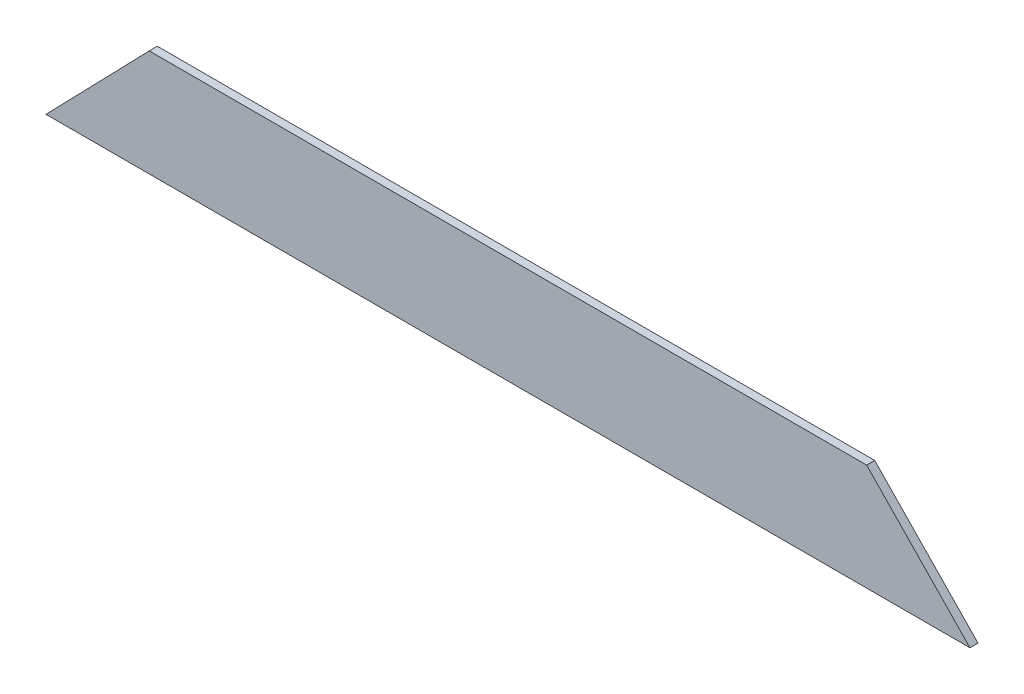
ISO-10303-21;
HEADER;
FILE_DESCRIPTION(('STEP AP214'),'2;1');
FILE_NAME('part.step','',(''),(''),'','','');
FILE_SCHEMA(('AUTOMOTIVE_DESIGN { 1 0 10303 214 1 1 1 1 }'));
ENDSEC;
DATA;
#1=APPLICATION_CONTEXT('core data for automotive mechanical design processes');
#2=APPLICATION_PROTOCOL_DEFINITION('international standard','automotive_design',2000,#1);
#3=PRODUCT_CONTEXT('',#1,'mechanical');
#4=PRODUCT('Part','Part','',(#3));
#5=PRODUCT_RELATED_PRODUCT_CATEGORY('part','',(#4));
#6=PRODUCT_DEFINITION_FORMATION('','',#4);
#7=PRODUCT_DEFINITION_CONTEXT('part definition',#1,'design');
#8=PRODUCT_DEFINITION('design','',#6,#7);
#9=PRODUCT_DEFINITION_SHAPE('','',#8);
#10=(LENGTH_UNIT() NAMED_UNIT(*) SI_UNIT(.MILLI.,.METRE.));
#11=(NAMED_UNIT(*) PLANE_ANGLE_UNIT() SI_UNIT($,.RADIAN.));
#12=(NAMED_UNIT(*) SI_UNIT($,.STERADIAN.) SOLID_ANGLE_UNIT());
#13=UNCERTAINTY_MEASURE_WITH_UNIT(LENGTH_MEASURE(1.E-05),#10,'distance_accuracy_value','');
#14=(GEOMETRIC_REPRESENTATION_CONTEXT(3) GLOBAL_UNCERTAINTY_ASSIGNED_CONTEXT((#13)) GLOBAL_UNIT_ASSIGNED_CONTEXT((#10,
#11,#12)) REPRESENTATION_CONTEXT('',''));
#15=CARTESIAN_POINT('',(0.,0.,0.));
#16=DIRECTION('',(0.,0.,1.));
#17=DIRECTION('',(1.,0.,0.));
#18=AXIS2_PLACEMENT_3D('',#15,#16,#17);
#19=CARTESIAN_POINT('',(-631.281602045428,550.076112520781,18.25625));
#20=DIRECTION('',(0.71812629776319,-0.695912796592313,0.));
#21=DIRECTION('',(0.695912796592313,0.71812629776319,0.));
#22=AXIS2_PLACEMENT_3D('',#19,#20,#21);
#23=PLANE('',#22);
#24=DIRECTION('',(-0.695912796592313,-0.71812629776319,0.));
#25=VECTOR('',#24,1.);
#26=CARTESIAN_POINT('',(-631.281602045428,550.076112520781,0.));
#27=LINE('',#26,#25);
#28=CARTESIAN_POINT('',(-631.281602045428,550.076112520781,0.));
#29=VERTEX_POINT('',#28);
#30=CARTESIAN_POINT('',(-865.117569814289,308.776112520781,0.));
#31=VERTEX_POINT('',#30);
#32=EDGE_CURVE('E95',#29,#31,#27,.T.);
#33=ORIENTED_EDGE('',*,*,#32,.T.);
#34=DIRECTION('',(0.,0.,-1.));
#35=VECTOR('',#34,1.);
#36=CARTESIAN_POINT('',(-865.117569814289,308.776112520781,18.25625));
#37=LINE('',#36,#35);
#38=CARTESIAN_POINT('',(-865.117569814289,308.776112520781,18.25625));
#39=VERTEX_POINT('',#38);
#40=EDGE_CURVE('E11',#39,#31,#37,.T.);
#41=ORIENTED_EDGE('',*,*,#40,.F.);
#42=DIRECTION('',(-0.695912796592313,-0.71812629776319,0.));
#43=VECTOR('',#42,1.);
#44=CARTESIAN_POINT('',(-631.281602045428,550.076112520781,18.25625));
#45=LINE('',#44,#43);
#46=CARTESIAN_POINT('',(-631.281602045428,550.076112520781,18.25625));
#47=VERTEX_POINT('',#46);
#48=EDGE_CURVE('E83',#47,#39,#45,.T.);
#49=ORIENTED_EDGE('',*,*,#48,.F.);
#50=DIRECTION('',(0.,0.,-1.));
#51=VECTOR('',#50,1.);
#52=CARTESIAN_POINT('',(-631.281602045428,550.076112520781,18.25625));
#53=LINE('',#52,#51);
#54=EDGE_CURVE('E91',#47,#29,#53,.T.);
#55=ORIENTED_EDGE('',*,*,#54,.T.);
#56=EDGE_LOOP('',(#33,#41,#49,#55));
#57=FACE_BOUND('',#56,.T.);
#58=ADVANCED_FACE('F32',(#57),#23,.F.);
#59=CARTESIAN_POINT('',(-681.751009276564,308.776112520781,18.25625));
#60=DIRECTION('',(0.,1.,0.));
#61=DIRECTION('',(-1.,0.,0.));
#62=AXIS2_PLACEMENT_3D('',#59,#60,#61);
#63=PLANE('',#62);
#64=DIRECTION('',(1.,0.,0.));
#65=VECTOR('',#64,1.);
#66=CARTESIAN_POINT('',(-681.751009276564,308.776112520781,0.));
#67=LINE('',#66,#65);
#68=CARTESIAN_POINT('',(1226.80499072344,308.776112520782,0.));
#69=VERTEX_POINT('',#68);
#70=EDGE_CURVE('E87',#31,#69,#67,.T.);
#71=ORIENTED_EDGE('',*,*,#70,.T.);
#72=DIRECTION('',(0.,0.,-1.));
#73=VECTOR('',#72,1.);
#74=CARTESIAN_POINT('',(1226.80499072344,308.776112520782,18.25625));
#75=LINE('',#74,#73);
#76=CARTESIAN_POINT('',(1226.80499072344,308.776112520782,18.25625));
#77=VERTEX_POINT('',#76);
#78=EDGE_CURVE('E40',#77,#69,#75,.T.);
#79=ORIENTED_EDGE('',*,*,#78,.F.);
#80=DIRECTION('',(1.,0.,0.));
#81=VECTOR('',#80,1.);
#82=CARTESIAN_POINT('',(-681.751009276564,308.776112520781,18.25625));
#83=LINE('',#82,#81);
#84=EDGE_CURVE('E78',#39,#77,#83,.T.);
#85=ORIENTED_EDGE('',*,*,#84,.F.);
#86=ORIENTED_EDGE('',*,*,#40,.T.);
#87=EDGE_LOOP('',(#71,#79,#85,#86));
#88=FACE_BOUND('',#87,.T.);
#89=ADVANCED_FACE('F86',(#88),#63,.F.);
#90=CARTESIAN_POINT('',(1226.80499072344,308.776112520782,18.25625));
#91=DIRECTION('',(-0.718126297763186,-0.695912796592318,0.));
#92=DIRECTION('',(0.695912796592318,-0.718126297763186,0.));
#93=AXIS2_PLACEMENT_3D('',#90,#91,#92);
#94=PLANE('',#93);
#95=DIRECTION('',(-0.695912796592318,0.718126297763186,0.));
#96=VECTOR('',#95,1.);
#97=CARTESIAN_POINT('',(1226.80499072344,308.776112520782,0.));
#98=LINE('',#97,#96);
#99=CARTESIAN_POINT('',(992.969022954572,550.076112520781,0.));
#100=VERTEX_POINT('',#99);
#101=EDGE_CURVE('E65',#69,#100,#98,.T.);
#102=ORIENTED_EDGE('',*,*,#101,.T.);
#103=DIRECTION('',(0.,0.,-1.));
#104=VECTOR('',#103,1.);
#105=CARTESIAN_POINT('',(992.969022954572,550.076112520781,18.25625));
#106=LINE('',#105,#104);
#107=CARTESIAN_POINT('',(992.969022954572,550.076112520781,18.25625));
#108=VERTEX_POINT('',#107);
#109=EDGE_CURVE('E88',#108,#100,#106,.T.);
#110=ORIENTED_EDGE('',*,*,#109,.F.);
#111=DIRECTION('',(-0.695912796592318,0.718126297763186,0.));
#112=VECTOR('',#111,1.);
#113=CARTESIAN_POINT('',(1226.80499072344,308.776112520782,18.25625));
#114=LINE('',#113,#112);
#115=EDGE_CURVE('E81',#77,#108,#114,.T.);
#116=ORIENTED_EDGE('',*,*,#115,.F.);
#117=ORIENTED_EDGE('',*,*,#78,.T.);
#118=EDGE_LOOP('',(#102,#110,#116,#117));
#119=FACE_BOUND('',#118,.T.);
#120=ADVANCED_FACE('F89',(#119),#94,.F.);
#121=CARTESIAN_POINT('',(-631.281602045428,550.076112520781,18.25625));
#122=DIRECTION('',(0.,-1.,0.));
#123=DIRECTION('',(0.,0.,-1.));
#124=AXIS2_PLACEMENT_3D('',#121,#122,#123);
#125=PLANE('',#124);
#126=DIRECTION('',(-1.,0.,0.));
#127=VECTOR('',#126,1.);
#128=CARTESIAN_POINT('',(-631.281602045428,550.076112520781,0.));
#129=LINE('',#128,#127);
#130=EDGE_CURVE('E71',#100,#29,#129,.T.);
#131=ORIENTED_EDGE('',*,*,#130,.T.);
#132=ORIENTED_EDGE('',*,*,#54,.F.);
#133=DIRECTION('',(-1.,0.,0.));
#134=VECTOR('',#133,1.);
#135=CARTESIAN_POINT('',(-631.281602045428,550.076112520781,18.25625));
#136=LINE('',#135,#134);
#137=EDGE_CURVE('E48',#108,#47,#136,.T.);
#138=ORIENTED_EDGE('',*,*,#137,.F.);
#139=ORIENTED_EDGE('',*,*,#109,.T.);
#140=EDGE_LOOP('',(#131,#132,#138,#139));
#141=FACE_BOUND('',#140,.T.);
#142=ADVANCED_FACE('F102',(#141),#125,.F.);
#143=CARTESIAN_POINT('',(0.,0.,18.25625));
#144=DIRECTION('',(0.,0.,-1.));
#145=DIRECTION('',(-1.,0.,0.));
#146=AXIS2_PLACEMENT_3D('',#143,#144,#145);
#147=PLANE('',#146);
#148=ORIENTED_EDGE('',*,*,#48,.T.);
#149=ORIENTED_EDGE('',*,*,#84,.T.);
#150=ORIENTED_EDGE('',*,*,#115,.T.);
#151=ORIENTED_EDGE('',*,*,#137,.T.);
#152=EDGE_LOOP('',(#148,#149,#150,#151));
#153=FACE_BOUND('',#152,.T.);
#154=ADVANCED_FACE('F79',(#153),#147,.F.);
#155=CARTESIAN_POINT('',(0.,0.,0.));
#156=DIRECTION('',(0.,0.,-1.));
#157=DIRECTION('',(-1.,0.,0.));
#158=AXIS2_PLACEMENT_3D('',#155,#156,#157);
#159=PLANE('',#158);
#160=ORIENTED_EDGE('',*,*,#32,.F.);
#161=ORIENTED_EDGE('',*,*,#130,.F.);
#162=ORIENTED_EDGE('',*,*,#101,.F.);
#163=ORIENTED_EDGE('',*,*,#70,.F.);
#164=EDGE_LOOP('',(#160,#161,#162,#163));
#165=FACE_BOUND('',#164,.T.);
#166=ADVANCED_FACE('F105',(#165),#159,.T.);
#167=CLOSED_SHELL('',(#58,#89,#120,#142,#154,#166));
#168=MANIFOLD_SOLID_BREP('B2',#167);
#169=ADVANCED_BREP_SHAPE_REPRESENTATION('',(#18,#168),#14);
#170=SHAPE_DEFINITION_REPRESENTATION(#9,#169);
ENDSEC;
END-ISO-10303-21;
